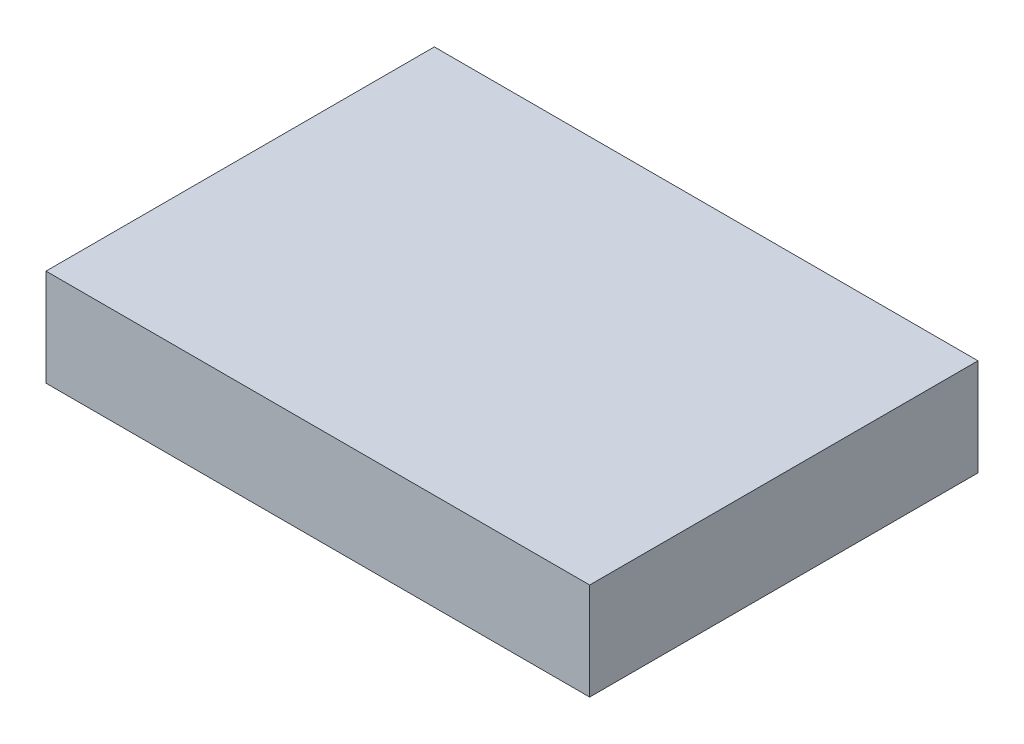
ISO-10303-21;
HEADER;
FILE_DESCRIPTION(('STEP AP214'),'2;1');
FILE_NAME('part.step','',(''),(''),'','','');
FILE_SCHEMA(('AUTOMOTIVE_DESIGN { 1 0 10303 214 1 1 1 1 }'));
ENDSEC;
DATA;
#1=APPLICATION_CONTEXT('core data for automotive mechanical design processes');
#2=APPLICATION_PROTOCOL_DEFINITION('international standard','automotive_design',2000,#1);
#3=PRODUCT_CONTEXT('',#1,'mechanical');
#4=PRODUCT('Part','Part','',(#3));
#5=PRODUCT_RELATED_PRODUCT_CATEGORY('part','',(#4));
#6=PRODUCT_DEFINITION_FORMATION('','',#4);
#7=PRODUCT_DEFINITION_CONTEXT('part definition',#1,'design');
#8=PRODUCT_DEFINITION('design','',#6,#7);
#9=PRODUCT_DEFINITION_SHAPE('','',#8);
#10=(LENGTH_UNIT() NAMED_UNIT(*) SI_UNIT(.MILLI.,.METRE.));
#11=(NAMED_UNIT(*) PLANE_ANGLE_UNIT() SI_UNIT($,.RADIAN.));
#12=(NAMED_UNIT(*) SI_UNIT($,.STERADIAN.) SOLID_ANGLE_UNIT());
#13=UNCERTAINTY_MEASURE_WITH_UNIT(LENGTH_MEASURE(1.E-05),#10,'distance_accuracy_value','');
#14=(GEOMETRIC_REPRESENTATION_CONTEXT(3) GLOBAL_UNCERTAINTY_ASSIGNED_CONTEXT((#13)) GLOBAL_UNIT_ASSIGNED_CONTEXT((#10,
#11,#12)) REPRESENTATION_CONTEXT('',''));
#15=CARTESIAN_POINT('',(0.,0.,0.));
#16=DIRECTION('',(0.,0.,1.));
#17=DIRECTION('',(1.,0.,0.));
#18=AXIS2_PLACEMENT_3D('',#15,#16,#17);
#19=CARTESIAN_POINT('',(88.9,31.75,63.5));
#20=DIRECTION('',(-1.,0.,0.));
#21=DIRECTION('',(0.,0.,1.));
#22=AXIS2_PLACEMENT_3D('',#19,#20,#21);
#23=PLANE('',#22);
#24=DIRECTION('',(0.,0.,-1.));
#25=VECTOR('',#24,1.);
#26=CARTESIAN_POINT('',(88.9,0.,63.5));
#27=LINE('',#26,#25);
#28=CARTESIAN_POINT('',(88.9,0.,63.5));
#29=VERTEX_POINT('',#28);
#30=CARTESIAN_POINT('',(88.9,0.,-63.5));
#31=VERTEX_POINT('',#30);
#32=EDGE_CURVE('E96',#29,#31,#27,.T.);
#33=ORIENTED_EDGE('',*,*,#32,.T.);
#34=DIRECTION('',(0.,-1.,0.));
#35=VECTOR('',#34,1.);
#36=CARTESIAN_POINT('',(88.9,31.75,-63.5));
#37=LINE('',#36,#35);
#38=CARTESIAN_POINT('',(88.9,31.75,-63.5));
#39=VERTEX_POINT('',#38);
#40=EDGE_CURVE('E11',#39,#31,#37,.T.);
#41=ORIENTED_EDGE('',*,*,#40,.F.);
#42=DIRECTION('',(0.,0.,-1.));
#43=VECTOR('',#42,1.);
#44=CARTESIAN_POINT('',(88.9,31.75,63.5));
#45=LINE('',#44,#43);
#46=CARTESIAN_POINT('',(88.9,31.75,63.5));
#47=VERTEX_POINT('',#46);
#48=EDGE_CURVE('E84',#47,#39,#45,.T.);
#49=ORIENTED_EDGE('',*,*,#48,.F.);
#50=DIRECTION('',(0.,-1.,0.));
#51=VECTOR('',#50,1.);
#52=CARTESIAN_POINT('',(88.9,31.75,63.5));
#53=LINE('',#52,#51);
#54=EDGE_CURVE('E92',#47,#29,#53,.T.);
#55=ORIENTED_EDGE('',*,*,#54,.T.);
#56=EDGE_LOOP('',(#33,#41,#49,#55));
#57=FACE_BOUND('',#56,.T.);
#58=ADVANCED_FACE('F33',(#57),#23,.F.);
#59=CARTESIAN_POINT('',(-88.9,31.75,-63.5));
#60=DIRECTION('',(0.,0.,1.));
#61=DIRECTION('',(1.,0.,0.));
#62=AXIS2_PLACEMENT_3D('',#59,#60,#61);
#63=PLANE('',#62);
#64=DIRECTION('',(-1.,0.,0.));
#65=VECTOR('',#64,1.);
#66=CARTESIAN_POINT('',(-88.9,0.,-63.5));
#67=LINE('',#66,#65);
#68=CARTESIAN_POINT('',(-88.9,0.,-63.5));
#69=VERTEX_POINT('',#68);
#70=EDGE_CURVE('E88',#31,#69,#67,.T.);
#71=ORIENTED_EDGE('',*,*,#70,.T.);
#72=DIRECTION('',(0.,-1.,0.));
#73=VECTOR('',#72,1.);
#74=CARTESIAN_POINT('',(-88.9,31.75,-63.5));
#75=LINE('',#74,#73);
#76=CARTESIAN_POINT('',(-88.9,31.75,-63.5));
#77=VERTEX_POINT('',#76);
#78=EDGE_CURVE('E41',#77,#69,#75,.T.);
#79=ORIENTED_EDGE('',*,*,#78,.F.);
#80=DIRECTION('',(-1.,0.,0.));
#81=VECTOR('',#80,1.);
#82=CARTESIAN_POINT('',(-88.9,31.75,-63.5));
#83=LINE('',#82,#81);
#84=EDGE_CURVE('E79',#39,#77,#83,.T.);
#85=ORIENTED_EDGE('',*,*,#84,.F.);
#86=ORIENTED_EDGE('',*,*,#40,.T.);
#87=EDGE_LOOP('',(#71,#79,#85,#86));
#88=FACE_BOUND('',#87,.T.);
#89=ADVANCED_FACE('F87',(#88),#63,.F.);
#90=CARTESIAN_POINT('',(-88.9,31.75,63.5));
#91=DIRECTION('',(1.,0.,0.));
#92=DIRECTION('',(0.,0.,-1.));
#93=AXIS2_PLACEMENT_3D('',#90,#91,#92);
#94=PLANE('',#93);
#95=DIRECTION('',(0.,0.,1.));
#96=VECTOR('',#95,1.);
#97=CARTESIAN_POINT('',(-88.9,0.,63.5));
#98=LINE('',#97,#96);
#99=CARTESIAN_POINT('',(-88.9,0.,63.5));
#100=VERTEX_POINT('',#99);
#101=EDGE_CURVE('E66',#69,#100,#98,.T.);
#102=ORIENTED_EDGE('',*,*,#101,.T.);
#103=DIRECTION('',(0.,-1.,0.));
#104=VECTOR('',#103,1.);
#105=CARTESIAN_POINT('',(-88.9,31.75,63.5));
#106=LINE('',#105,#104);
#107=CARTESIAN_POINT('',(-88.9,31.75,63.5));
#108=VERTEX_POINT('',#107);
#109=EDGE_CURVE('E89',#108,#100,#106,.T.);
#110=ORIENTED_EDGE('',*,*,#109,.F.);
#111=DIRECTION('',(0.,0.,1.));
#112=VECTOR('',#111,1.);
#113=CARTESIAN_POINT('',(-88.9,31.75,63.5));
#114=LINE('',#113,#112);
#115=EDGE_CURVE('E82',#77,#108,#114,.T.);
#116=ORIENTED_EDGE('',*,*,#115,.F.);
#117=ORIENTED_EDGE('',*,*,#78,.T.);
#118=EDGE_LOOP('',(#102,#110,#116,#117));
#119=FACE_BOUND('',#118,.T.);
#120=ADVANCED_FACE('F90',(#119),#94,.F.);
#121=CARTESIAN_POINT('',(-88.9,31.75,63.5));
#122=DIRECTION('',(0.,0.,-1.));
#123=DIRECTION('',(-1.,0.,0.));
#124=AXIS2_PLACEMENT_3D('',#121,#122,#123);
#125=PLANE('',#124);
#126=DIRECTION('',(1.,0.,0.));
#127=VECTOR('',#126,1.);
#128=CARTESIAN_POINT('',(-88.9,0.,63.5));
#129=LINE('',#128,#127);
#130=EDGE_CURVE('E72',#100,#29,#129,.T.);
#131=ORIENTED_EDGE('',*,*,#130,.T.);
#132=ORIENTED_EDGE('',*,*,#54,.F.);
#133=DIRECTION('',(1.,0.,0.));
#134=VECTOR('',#133,1.);
#135=CARTESIAN_POINT('',(-88.9,31.75,63.5));
#136=LINE('',#135,#134);
#137=EDGE_CURVE('E49',#108,#47,#136,.T.);
#138=ORIENTED_EDGE('',*,*,#137,.F.);
#139=ORIENTED_EDGE('',*,*,#109,.T.);
#140=EDGE_LOOP('',(#131,#132,#138,#139));
#141=FACE_BOUND('',#140,.T.);
#142=ADVANCED_FACE('F103',(#141),#125,.F.);
#143=CARTESIAN_POINT('',(0.,31.75,0.));
#144=DIRECTION('',(0.,-1.,0.));
#145=DIRECTION('',(0.,0.,-1.));
#146=AXIS2_PLACEMENT_3D('',#143,#144,#145);
#147=PLANE('',#146);
#148=ORIENTED_EDGE('',*,*,#48,.T.);
#149=ORIENTED_EDGE('',*,*,#84,.T.);
#150=ORIENTED_EDGE('',*,*,#115,.T.);
#151=ORIENTED_EDGE('',*,*,#137,.T.);
#152=EDGE_LOOP('',(#148,#149,#150,#151));
#153=FACE_BOUND('',#152,.T.);
#154=ADVANCED_FACE('F80',(#153),#147,.F.);
#155=CARTESIAN_POINT('',(0.,0.,0.));
#156=DIRECTION('',(0.,-1.,0.));
#157=DIRECTION('',(0.,0.,-1.));
#158=AXIS2_PLACEMENT_3D('',#155,#156,#157);
#159=PLANE('',#158);
#160=ORIENTED_EDGE('',*,*,#32,.F.);
#161=ORIENTED_EDGE('',*,*,#130,.F.);
#162=ORIENTED_EDGE('',*,*,#101,.F.);
#163=ORIENTED_EDGE('',*,*,#70,.F.);
#164=EDGE_LOOP('',(#160,#161,#162,#163));
#165=FACE_BOUND('',#164,.T.);
#166=ADVANCED_FACE('F106',(#165),#159,.T.);
#167=CLOSED_SHELL('',(#58,#89,#120,#142,#154,#166));
#168=MANIFOLD_SOLID_BREP('B2',#167);
#169=ADVANCED_BREP_SHAPE_REPRESENTATION('',(#18,#168),#14);
#170=SHAPE_DEFINITION_REPRESENTATION(#9,#169);
ENDSEC;
END-ISO-10303-21;
